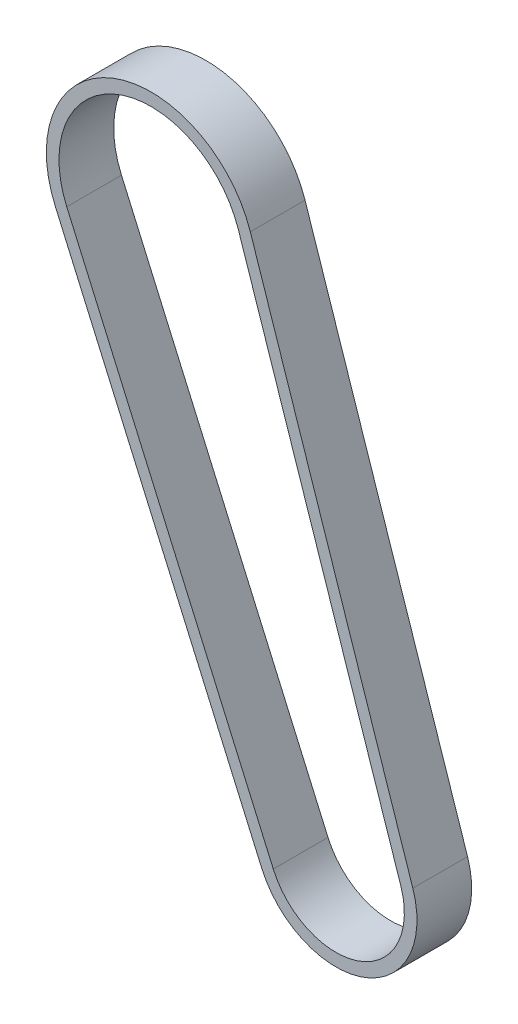
ISO-10303-21;
HEADER;
FILE_DESCRIPTION(('STEP AP214'),'2;1');
FILE_NAME('part.step','',(''),(''),'','','');
FILE_SCHEMA(('AUTOMOTIVE_DESIGN { 1 0 10303 214 1 1 1 1 }'));
ENDSEC;
DATA;
#1=APPLICATION_CONTEXT('core data for automotive mechanical design processes');
#2=APPLICATION_PROTOCOL_DEFINITION('international standard','automotive_design',2000,#1);
#3=PRODUCT_CONTEXT('',#1,'mechanical');
#4=PRODUCT('Part','Part','',(#3));
#5=PRODUCT_RELATED_PRODUCT_CATEGORY('part','',(#4));
#6=PRODUCT_DEFINITION_FORMATION('','',#4);
#7=PRODUCT_DEFINITION_CONTEXT('part definition',#1,'design');
#8=PRODUCT_DEFINITION('design','',#6,#7);
#9=PRODUCT_DEFINITION_SHAPE('','',#8);
#10=(LENGTH_UNIT() NAMED_UNIT(*) SI_UNIT(.MILLI.,.METRE.));
#11=(NAMED_UNIT(*) PLANE_ANGLE_UNIT() SI_UNIT($,.RADIAN.));
#12=(NAMED_UNIT(*) SI_UNIT($,.STERADIAN.) SOLID_ANGLE_UNIT());
#13=UNCERTAINTY_MEASURE_WITH_UNIT(LENGTH_MEASURE(1.E-05),#10,'distance_accuracy_value','');
#14=(GEOMETRIC_REPRESENTATION_CONTEXT(3) GLOBAL_UNCERTAINTY_ASSIGNED_CONTEXT((#13)) GLOBAL_UNIT_ASSIGNED_CONTEXT((#10,
#11,#12)) REPRESENTATION_CONTEXT('',''));
#15=CARTESIAN_POINT('',(0.,0.,0.));
#16=DIRECTION('',(0.,0.,1.));
#17=DIRECTION('',(1.,0.,0.));
#18=AXIS2_PLACEMENT_3D('',#15,#16,#17);
#19=CARTESIAN_POINT('',(21.6527788529142,2.1134142767876,164.115855841013));
#20=DIRECTION('',(-0.948616377455622,-0.316428457037248,0.));
#21=DIRECTION('',(0.316428457037248,-0.948616377455622,0.));
#22=AXIS2_PLACEMENT_3D('',#19,#20,#21);
#23=PLANE('',#22);
#24=DIRECTION('',(-0.316428457037248,0.948616377455622,0.));
#25=VECTOR('',#24,1.);
#26=CARTESIAN_POINT('',(21.6527788529141,2.11341427678799,10.9999999999404));
#27=LINE('',#26,#25);
#28=CARTESIAN_POINT('',(54.3203429863675,-95.8202122962731,10.9999999999403));
#29=VERTEX_POINT('',#28);
#30=CARTESIAN_POINT('',(21.6527788529142,2.1134142767876,10.9999999999404));
#31=VERTEX_POINT('',#30);
#32=EDGE_CURVE('E181',#29,#31,#27,.T.);
#33=ORIENTED_EDGE('',*,*,#32,.F.);
#34=DIRECTION('',(0.,0.,-1.));
#35=VECTOR('',#34,1.);
#36=CARTESIAN_POINT('',(54.3203429863675,-95.8202122962731,164.115855841013));
#37=LINE('',#36,#35);
#38=CARTESIAN_POINT('',(54.3203429863675,-95.8202122962731,0.));
#39=VERTEX_POINT('',#38);
#40=EDGE_CURVE('E72',#29,#39,#37,.T.);
#41=ORIENTED_EDGE('',*,*,#40,.T.);
#42=DIRECTION('',(-0.316428457037248,0.948616377455622,0.));
#43=VECTOR('',#42,1.);
#44=CARTESIAN_POINT('',(21.6527788529142,2.1134142767876,0.));
#45=LINE('',#44,#43);
#46=CARTESIAN_POINT('',(21.6527788529142,2.1134142767876,0.));
#47=VERTEX_POINT('',#46);
#48=EDGE_CURVE('E155',#39,#47,#45,.T.);
#49=ORIENTED_EDGE('',*,*,#48,.T.);
#50=DIRECTION('',(0.,0.,-1.));
#51=VECTOR('',#50,1.);
#52=CARTESIAN_POINT('',(21.6527788529142,2.1134142767876,164.115855841013));
#53=LINE('',#52,#51);
#54=EDGE_CURVE('E158',#31,#47,#53,.T.);
#55=ORIENTED_EDGE('',*,*,#54,.F.);
#56=EDGE_LOOP('',(#33,#41,#49,#55));
#57=FACE_BOUND('',#56,.T.);
#58=ADVANCED_FACE('F57',(#57),#23,.F.);
#59=CARTESIAN_POINT('',(38.8626391157281,-100.976414003695,164.115855841013));
#60=DIRECTION('',(0.,0.,-1.));
#61=DIRECTION('',(-1.,0.,0.));
#62=AXIS2_PLACEMENT_3D('',#59,#60,#61);
#63=CYLINDRICAL_SURFACE('',#62,16.295);
#64=CARTESIAN_POINT('',(38.8626391157281,-100.976414003695,10.9999999999401));
#65=DIRECTION('',(0.,0.,1.));
#66=DIRECTION('',(0.,-1.,0.));
#67=AXIS2_PLACEMENT_3D('',#64,#65,#66);
#68=CIRCLE('',#67,16.295);
#69=CARTESIAN_POINT('',(23.9430806256597,-107.528802839946,10.9999999999401));
#70=VERTEX_POINT('',#69);
#71=EDGE_CURVE('E184',#70,#29,#68,.T.);
#72=ORIENTED_EDGE('',*,*,#71,.F.);
#73=DIRECTION('',(0.,0.,-1.));
#74=VECTOR('',#73,1.);
#75=CARTESIAN_POINT('',(23.9430806256597,-107.528802839946,164.115855841013));
#76=LINE('',#75,#74);
#77=CARTESIAN_POINT('',(23.9430806256597,-107.528802839946,0.));
#78=VERTEX_POINT('',#77);
#79=EDGE_CURVE('E161',#70,#78,#76,.T.);
#80=ORIENTED_EDGE('',*,*,#79,.T.);
#81=CARTESIAN_POINT('',(38.8626391157281,-100.976414003695,0.));
#82=DIRECTION('',(0.,0.,-1.));
#83=DIRECTION('',(-1.,0.,0.));
#84=AXIS2_PLACEMENT_3D('',#81,#82,#83);
#85=CIRCLE('',#84,16.295);
#86=EDGE_CURVE('E153',#78,#39,#85,.F.);
#87=ORIENTED_EDGE('',*,*,#86,.T.);
#88=ORIENTED_EDGE('',*,*,#40,.F.);
#89=EDGE_LOOP('',(#72,#80,#87,#88));
#90=FACE_BOUND('',#89,.T.);
#91=ADVANCED_FACE('F183',(#90),#63,.T.);
#92=CARTESIAN_POINT('',(-17.5701484296443,-13.0046431051628,164.115855841013));
#93=DIRECTION('',(0.915591193008185,0.402110391914768,0.));
#94=DIRECTION('',(-0.402110391914768,0.915591193008185,0.));
#95=AXIS2_PLACEMENT_3D('',#92,#93,#94);
#96=PLANE('',#95);
#97=DIRECTION('',(0.402110391914768,-0.915591193008185,0.));
#98=VECTOR('',#97,1.);
#99=CARTESIAN_POINT('',(-17.5701484296444,-13.0046431051624,10.9999999999404));
#100=LINE('',#99,#98);
#101=CARTESIAN_POINT('',(-17.5701484296443,-13.0046431051628,10.9999999999402));
#102=VERTEX_POINT('',#101);
#103=EDGE_CURVE('E169',#102,#70,#100,.T.);
#104=ORIENTED_EDGE('',*,*,#103,.F.);
#105=DIRECTION('',(0.,0.,-1.));
#106=VECTOR('',#105,1.);
#107=CARTESIAN_POINT('',(-17.5701484296443,-13.0046431051628,164.115855841013));
#108=LINE('',#107,#106);
#109=CARTESIAN_POINT('',(-17.5701484296443,-13.0046431051628,0.));
#110=VERTEX_POINT('',#109);
#111=EDGE_CURVE('E65',#102,#110,#108,.T.);
#112=ORIENTED_EDGE('',*,*,#111,.T.);
#113=DIRECTION('',(0.402110391914768,-0.915591193008185,0.));
#114=VECTOR('',#113,1.);
#115=CARTESIAN_POINT('',(-17.5701484296443,-13.0046431051628,0.));
#116=LINE('',#115,#114);
#117=EDGE_CURVE('E150',#110,#78,#116,.T.);
#118=ORIENTED_EDGE('',*,*,#117,.T.);
#119=ORIENTED_EDGE('',*,*,#79,.F.);
#120=EDGE_LOOP('',(#104,#112,#118,#119));
#121=FACE_BOUND('',#120,.T.);
#122=ADVANCED_FACE('F165',(#121),#96,.F.);
#123=CARTESIAN_POINT('',(1.69389027124794,-4.54424045927609,164.115855841013));
#124=DIRECTION('',(0.,0.,-1.));
#125=DIRECTION('',(-1.,0.,0.));
#126=AXIS2_PLACEMENT_3D('',#123,#124,#125);
#127=CYLINDRICAL_SURFACE('',#126,21.04);
#128=CARTESIAN_POINT('',(1.69389027124794,-4.54424045927609,10.9999999999404));
#129=DIRECTION('',(0.,0.,1.));
#130=DIRECTION('',(0.,-1.,0.));
#131=AXIS2_PLACEMENT_3D('',#128,#129,#130);
#132=CIRCLE('',#131,21.04);
#133=EDGE_CURVE('E178',#31,#102,#132,.T.);
#134=ORIENTED_EDGE('',*,*,#133,.F.);
#135=ORIENTED_EDGE('',*,*,#54,.T.);
#136=CARTESIAN_POINT('',(1.69389027124794,-4.54424045927609,0.));
#137=DIRECTION('',(0.,0.,-1.));
#138=DIRECTION('',(-1.,0.,0.));
#139=AXIS2_PLACEMENT_3D('',#136,#137,#138);
#140=CIRCLE('',#139,21.04);
#141=EDGE_CURVE('E147',#47,#110,#140,.F.);
#142=ORIENTED_EDGE('',*,*,#141,.T.);
#143=ORIENTED_EDGE('',*,*,#111,.F.);
#144=EDGE_LOOP('',(#134,#135,#142,#143));
#145=FACE_BOUND('',#144,.T.);
#146=ADVANCED_FACE('F59',(#145),#127,.T.);
#147=CARTESIAN_POINT('',(1.69389027124794,-4.54424045927609,0.));
#148=DIRECTION('',(0.,0.,-1.));
#149=DIRECTION('',(-1.,0.,0.));
#150=AXIS2_PLACEMENT_3D('',#147,#148,#149);
#151=PLANE('',#150);
#152=ORIENTED_EDGE('',*,*,#141,.F.);
#153=ORIENTED_EDGE('',*,*,#48,.F.);
#154=ORIENTED_EDGE('',*,*,#86,.F.);
#155=ORIENTED_EDGE('',*,*,#117,.F.);
#156=EDGE_LOOP('',(#152,#153,#154,#155));
#157=FACE_BOUND('',#156,.T.);
#158=DIRECTION('',(-0.316428457037248,0.948616377455622,0.));
#159=VECTOR('',#158,1.);
#160=CARTESIAN_POINT('',(19.2432932541769,1.30968599591299,0.));
#161=LINE('',#160,#159);
#162=CARTESIAN_POINT('',(51.9108573876302,-96.6239405771477,0.));
#163=VERTEX_POINT('',#162);
#164=CARTESIAN_POINT('',(19.2432932541769,1.30968599591299,0.));
#165=VERTEX_POINT('',#164);
#166=EDGE_CURVE('E137',#163,#165,#161,.T.);
#167=ORIENTED_EDGE('',*,*,#166,.T.);
#168=CARTESIAN_POINT('',(1.69389027124794,-4.54424045927609,0.));
#169=DIRECTION('',(0.,0.,1.));
#170=DIRECTION('',(-1.,0.,0.));
#171=AXIS2_PLACEMENT_3D('',#168,#169,#170);
#172=CIRCLE('',#171,18.5);
#173=CARTESIAN_POINT('',(-15.2445467994035,-11.9832827096993,0.));
#174=VERTEX_POINT('',#173);
#175=EDGE_CURVE('E186',#165,#174,#172,.T.);
#176=ORIENTED_EDGE('',*,*,#175,.T.);
#177=DIRECTION('',(0.402110391914768,-0.915591193008185,0.));
#178=VECTOR('',#177,1.);
#179=CARTESIAN_POINT('',(26.2686822559005,-106.507442444483,0.));
#180=LINE('',#179,#178);
#181=CARTESIAN_POINT('',(26.2686822559005,-106.507442444483,0.));
#182=VERTEX_POINT('',#181);
#183=EDGE_CURVE('E193',#174,#182,#180,.T.);
#184=ORIENTED_EDGE('',*,*,#183,.T.);
#185=CARTESIAN_POINT('',(38.8626391157281,-100.976414003695,0.));
#186=DIRECTION('',(0.,0.,1.));
#187=DIRECTION('',(-1.,0.,0.));
#188=AXIS2_PLACEMENT_3D('',#185,#186,#187);
#189=CIRCLE('',#188,13.755);
#190=EDGE_CURVE('E196',#182,#163,#189,.T.);
#191=ORIENTED_EDGE('',*,*,#190,.T.);
#192=EDGE_LOOP('',(#167,#176,#184,#191));
#193=FACE_BOUND('',#192,.T.);
#194=ADVANCED_FACE('F175',(#157,#193),#151,.T.);
#195=CARTESIAN_POINT('',(19.2432932541769,1.30968599591299,164.115855841013));
#196=DIRECTION('',(-0.948616377455622,-0.316428457037248,0.));
#197=DIRECTION('',(0.316428457037248,-0.948616377455622,0.));
#198=AXIS2_PLACEMENT_3D('',#195,#196,#197);
#199=PLANE('',#198);
#200=DIRECTION('',(0.,0.,-1.));
#201=VECTOR('',#200,1.);
#202=CARTESIAN_POINT('',(51.9108573876302,-96.6239405771477,164.115855841013));
#203=LINE('',#202,#201);
#204=CARTESIAN_POINT('',(51.9108573876302,-96.6239405771477,10.9999999999401));
#205=VERTEX_POINT('',#204);
#206=EDGE_CURVE('E129',#205,#163,#203,.T.);
#207=ORIENTED_EDGE('',*,*,#206,.F.);
#208=DIRECTION('',(-0.316428457037248,0.948616377455622,0.));
#209=VECTOR('',#208,1.);
#210=CARTESIAN_POINT('',(19.2432932541768,1.30968599591338,10.9999999999404));
#211=LINE('',#210,#209);
#212=CARTESIAN_POINT('',(19.2432932541769,1.30968599591299,10.9999999999403));
#213=VERTEX_POINT('',#212);
#214=EDGE_CURVE('E12',#205,#213,#211,.T.);
#215=ORIENTED_EDGE('',*,*,#214,.T.);
#216=DIRECTION('',(0.,0.,-1.));
#217=VECTOR('',#216,1.);
#218=CARTESIAN_POINT('',(19.2432932541769,1.30968599591299,164.115855841013));
#219=LINE('',#218,#217);
#220=EDGE_CURVE('E139',#213,#165,#219,.T.);
#221=ORIENTED_EDGE('',*,*,#220,.T.);
#222=ORIENTED_EDGE('',*,*,#166,.F.);
#223=EDGE_LOOP('',(#207,#215,#221,#222));
#224=FACE_BOUND('',#223,.T.);
#225=ADVANCED_FACE('F135',(#224),#199,.T.);
#226=CARTESIAN_POINT('',(38.8626391157281,-100.976414003695,164.115855841013));
#227=DIRECTION('',(0.,0.,-1.));
#228=DIRECTION('',(-1.,0.,0.));
#229=AXIS2_PLACEMENT_3D('',#226,#227,#228);
#230=CYLINDRICAL_SURFACE('',#229,13.755);
#231=DIRECTION('',(0.,0.,-1.));
#232=VECTOR('',#231,1.);
#233=CARTESIAN_POINT('',(26.2686822559005,-106.507442444483,164.115855841013));
#234=LINE('',#233,#232);
#235=CARTESIAN_POINT('',(26.2686822559005,-106.507442444483,10.9999999999401));
#236=VERTEX_POINT('',#235);
#237=EDGE_CURVE('E131',#236,#182,#234,.T.);
#238=ORIENTED_EDGE('',*,*,#237,.F.);
#239=CARTESIAN_POINT('',(38.8626391157281,-100.976414003695,10.9999999999401));
#240=DIRECTION('',(0.,0.,1.));
#241=DIRECTION('',(0.,-1.,0.));
#242=AXIS2_PLACEMENT_3D('',#239,#240,#241);
#243=CIRCLE('',#242,13.755);
#244=EDGE_CURVE('E122',#236,#205,#243,.T.);
#245=ORIENTED_EDGE('',*,*,#244,.T.);
#246=ORIENTED_EDGE('',*,*,#206,.T.);
#247=ORIENTED_EDGE('',*,*,#190,.F.);
#248=EDGE_LOOP('',(#238,#245,#246,#247));
#249=FACE_BOUND('',#248,.T.);
#250=ADVANCED_FACE('F127',(#249),#230,.F.);
#251=CARTESIAN_POINT('',(26.2686822559005,-106.507442444483,164.115855841013));
#252=DIRECTION('',(0.915591193008185,0.402110391914768,0.));
#253=DIRECTION('',(-0.402110391914768,0.915591193008185,0.));
#254=AXIS2_PLACEMENT_3D('',#251,#252,#253);
#255=PLANE('',#254);
#256=DIRECTION('',(0.,0.,-1.));
#257=VECTOR('',#256,1.);
#258=CARTESIAN_POINT('',(-15.2445467994035,-11.9832827096993,164.115855841013));
#259=LINE('',#258,#257);
#260=CARTESIAN_POINT('',(-15.2445467994035,-11.9832827096993,10.9999999999404));
#261=VERTEX_POINT('',#260);
#262=EDGE_CURVE('E141',#261,#174,#259,.T.);
#263=ORIENTED_EDGE('',*,*,#262,.F.);
#264=DIRECTION('',(0.402110391914768,-0.915591193008185,0.));
#265=VECTOR('',#264,1.);
#266=CARTESIAN_POINT('',(26.2686822559003,-106.507442444482,10.9999999999401));
#267=LINE('',#266,#265);
#268=EDGE_CURVE('E133',#261,#236,#267,.T.);
#269=ORIENTED_EDGE('',*,*,#268,.T.);
#270=ORIENTED_EDGE('',*,*,#237,.T.);
#271=ORIENTED_EDGE('',*,*,#183,.F.);
#272=EDGE_LOOP('',(#263,#269,#270,#271));
#273=FACE_BOUND('',#272,.T.);
#274=ADVANCED_FACE('F201',(#273),#255,.T.);
#275=CARTESIAN_POINT('',(1.69389027124794,-4.54424045927609,164.115855841013));
#276=DIRECTION('',(0.,0.,-1.));
#277=DIRECTION('',(-1.,0.,0.));
#278=AXIS2_PLACEMENT_3D('',#275,#276,#277);
#279=CYLINDRICAL_SURFACE('',#278,18.5);
#280=ORIENTED_EDGE('',*,*,#220,.F.);
#281=CARTESIAN_POINT('',(1.69389027124794,-4.54424045927609,10.9999999999404));
#282=DIRECTION('',(0.,0.,1.));
#283=DIRECTION('',(0.,-1.,0.));
#284=AXIS2_PLACEMENT_3D('',#281,#282,#283);
#285=CIRCLE('',#284,18.5);
#286=EDGE_CURVE('E80',#213,#261,#285,.T.);
#287=ORIENTED_EDGE('',*,*,#286,.T.);
#288=ORIENTED_EDGE('',*,*,#262,.T.);
#289=ORIENTED_EDGE('',*,*,#175,.F.);
#290=EDGE_LOOP('',(#280,#287,#288,#289));
#291=FACE_BOUND('',#290,.T.);
#292=ADVANCED_FACE('F205',(#291),#279,.F.);
#293=CARTESIAN_POINT('',(38.8626391157281,-100.976414003695,10.9999999999401));
#294=DIRECTION('',(0.,0.,1.));
#295=DIRECTION('',(0.229248141750129,0.973368013396841,0.));
#296=AXIS2_PLACEMENT_3D('',#293,#294,#295);
#297=PLANE('',#296);
#298=ORIENTED_EDGE('',*,*,#286,.F.);
#299=ORIENTED_EDGE('',*,*,#214,.F.);
#300=ORIENTED_EDGE('',*,*,#244,.F.);
#301=ORIENTED_EDGE('',*,*,#268,.F.);
#302=EDGE_LOOP('',(#298,#299,#300,#301));
#303=FACE_BOUND('',#302,.T.);
#304=ORIENTED_EDGE('',*,*,#32,.T.);
#305=ORIENTED_EDGE('',*,*,#133,.T.);
#306=ORIENTED_EDGE('',*,*,#103,.T.);
#307=ORIENTED_EDGE('',*,*,#71,.T.);
#308=EDGE_LOOP('',(#304,#305,#306,#307));
#309=FACE_BOUND('',#308,.T.);
#310=ADVANCED_FACE('F120',(#303,#309),#297,.T.);
#311=CLOSED_SHELL('',(#58,#91,#122,#146,#194,#225,#250,#274,#292,#310));
#312=MANIFOLD_SOLID_BREP('B2',#311);
#313=ADVANCED_BREP_SHAPE_REPRESENTATION('',(#18,#312),#14);
#314=SHAPE_DEFINITION_REPRESENTATION(#9,#313);
ENDSEC;
END-ISO-10303-21;
